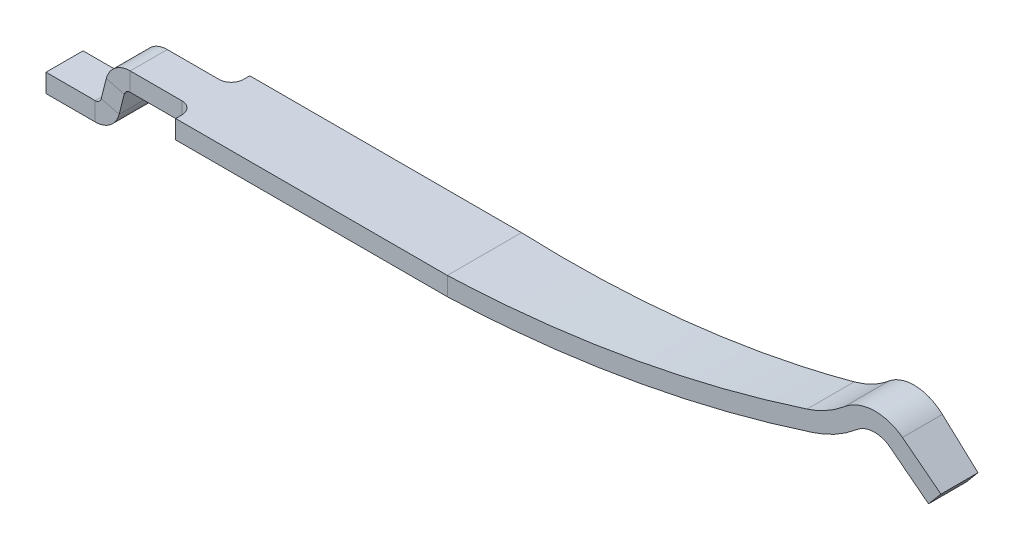
ISO-10303-21;
HEADER;
FILE_DESCRIPTION(('STEP AP214'),'2;1');
FILE_NAME('part.step','',(''),(''),'','','');
FILE_SCHEMA(('AUTOMOTIVE_DESIGN { 1 0 10303 214 1 1 1 1 }'));
ENDSEC;
DATA;
#1=APPLICATION_CONTEXT('core data for automotive mechanical design processes');
#2=APPLICATION_PROTOCOL_DEFINITION('international standard','automotive_design',2000,#1);
#3=PRODUCT_CONTEXT('',#1,'mechanical');
#4=PRODUCT('Part','Part','',(#3));
#5=PRODUCT_RELATED_PRODUCT_CATEGORY('part','',(#4));
#6=PRODUCT_DEFINITION_FORMATION('','',#4);
#7=PRODUCT_DEFINITION_CONTEXT('part definition',#1,'design');
#8=PRODUCT_DEFINITION('design','',#6,#7);
#9=PRODUCT_DEFINITION_SHAPE('','',#8);
#10=(LENGTH_UNIT() NAMED_UNIT(*) SI_UNIT(.MILLI.,.METRE.));
#11=(NAMED_UNIT(*) PLANE_ANGLE_UNIT() SI_UNIT($,.RADIAN.));
#12=(NAMED_UNIT(*) SI_UNIT($,.STERADIAN.) SOLID_ANGLE_UNIT());
#13=UNCERTAINTY_MEASURE_WITH_UNIT(LENGTH_MEASURE(1.E-05),#10,'distance_accuracy_value','');
#14=(GEOMETRIC_REPRESENTATION_CONTEXT(3) GLOBAL_UNCERTAINTY_ASSIGNED_CONTEXT((#13)) GLOBAL_UNIT_ASSIGNED_CONTEXT((#10,
#11,#12)) REPRESENTATION_CONTEXT('',''));
#15=CARTESIAN_POINT('',(0.,0.,0.));
#16=DIRECTION('',(0.,0.,1.));
#17=DIRECTION('',(1.,0.,0.));
#18=AXIS2_PLACEMENT_3D('',#15,#16,#17);
#19=CARTESIAN_POINT('',(0.,0.,0.));
#20=DIRECTION('',(1.,0.,0.));
#21=DIRECTION('',(0.,0.,-1.));
#22=AXIS2_PLACEMENT_3D('',#19,#20,#21);
#23=PLANE('',#22);
#24=DIRECTION('',(0.,0.,-1.));
#25=VECTOR('',#24,1.);
#26=CARTESIAN_POINT('',(0.,0.35,0.3));
#27=LINE('',#26,#25);
#28=CARTESIAN_POINT('',(0.,0.35,-0.25));
#29=VERTEX_POINT('',#28);
#30=CARTESIAN_POINT('',(0.,0.35,-0.3));
#31=VERTEX_POINT('',#30);
#32=EDGE_CURVE('E349',#29,#31,#27,.T.);
#33=ORIENTED_EDGE('',*,*,#32,.F.);
#34=DIRECTION('',(0.,1.,0.));
#35=VECTOR('',#34,1.);
#36=CARTESIAN_POINT('',(0.,0.,-0.25));
#37=LINE('',#36,#35);
#38=CARTESIAN_POINT('',(0.,0.5,-0.25));
#39=VERTEX_POINT('',#38);
#40=EDGE_CURVE('E378',#29,#39,#37,.T.);
#41=ORIENTED_EDGE('',*,*,#40,.T.);
#42=DIRECTION('',(0.,0.,-1.));
#43=VECTOR('',#42,1.);
#44=CARTESIAN_POINT('',(0.,0.5,0.3));
#45=LINE('',#44,#43);
#46=CARTESIAN_POINT('',(0.,0.5,-0.3));
#47=VERTEX_POINT('',#46);
#48=EDGE_CURVE('E359',#39,#47,#45,.T.);
#49=ORIENTED_EDGE('',*,*,#48,.T.);
#50=DIRECTION('',(0.,-1.,0.));
#51=VECTOR('',#50,1.);
#52=CARTESIAN_POINT('',(0.,0.5,-0.3));
#53=LINE('',#52,#51);
#54=EDGE_CURVE('E355',#47,#31,#53,.T.);
#55=ORIENTED_EDGE('',*,*,#54,.T.);
#56=EDGE_LOOP('',(#33,#41,#49,#55));
#57=FACE_BOUND('',#56,.T.);
#58=ADVANCED_FACE('F37',(#57),#23,.F.);
#59=CARTESIAN_POINT('',(1.7,0.5,0.3));
#60=DIRECTION('',(0.,0.,-1.));
#61=DIRECTION('',(0.,1.,0.));
#62=AXIS2_PLACEMENT_3D('',#59,#60,#61);
#63=PLANE('',#62);
#64=DIRECTION('',(0.,-1.,0.));
#65=VECTOR('',#64,1.);
#66=CARTESIAN_POINT('',(0.,0.5,0.3));
#67=LINE('',#66,#65);
#68=CARTESIAN_POINT('',(0.,0.5,0.3));
#69=VERTEX_POINT('',#68);
#70=CARTESIAN_POINT('',(0.,0.35,0.3));
#71=VERTEX_POINT('',#70);
#72=EDGE_CURVE('E345',#69,#71,#67,.T.);
#73=ORIENTED_EDGE('',*,*,#72,.T.);
#74=DIRECTION('',(-1.,0.,0.));
#75=VECTOR('',#74,1.);
#76=CARTESIAN_POINT('',(1.7,0.35,0.3));
#77=LINE('',#76,#75);
#78=CARTESIAN_POINT('',(2.2,0.35,0.3));
#79=VERTEX_POINT('',#78);
#80=EDGE_CURVE('E374',#79,#71,#77,.T.);
#81=ORIENTED_EDGE('',*,*,#80,.F.);
#82=DIRECTION('',(0.,-1.,0.));
#83=VECTOR('',#82,1.);
#84=CARTESIAN_POINT('',(2.2,0.5,0.3));
#85=LINE('',#84,#83);
#86=CARTESIAN_POINT('',(2.2,0.5,0.3));
#87=VERTEX_POINT('',#86);
#88=EDGE_CURVE('E591',#87,#79,#85,.T.);
#89=ORIENTED_EDGE('',*,*,#88,.F.);
#90=DIRECTION('',(-1.,0.,0.));
#91=VECTOR('',#90,1.);
#92=CARTESIAN_POINT('',(1.7,0.5,0.3));
#93=LINE('',#92,#91);
#94=EDGE_CURVE('E363',#87,#69,#93,.T.);
#95=ORIENTED_EDGE('',*,*,#94,.T.);
#96=EDGE_LOOP('',(#73,#81,#89,#95));
#97=FACE_BOUND('',#96,.T.);
#98=ADVANCED_FACE('F652',(#97),#63,.F.);
#99=CARTESIAN_POINT('',(1.7,0.35,0.3));
#100=DIRECTION('',(0.,1.,0.));
#101=DIRECTION('',(0.,0.,1.));
#102=AXIS2_PLACEMENT_3D('',#99,#100,#101);
#103=PLANE('',#102);
#104=CARTESIAN_POINT('',(0.,0.35,0.25));
#105=VERTEX_POINT('',#104);
#106=EDGE_CURVE('E351',#71,#105,#27,.T.);
#107=ORIENTED_EDGE('',*,*,#106,.T.);
#108=CARTESIAN_POINT('',(-0.1,0.35,0.25));
#109=DIRECTION('',(0.,1.,0.));
#110=DIRECTION('',(0.,0.,1.));
#111=AXIS2_PLACEMENT_3D('',#108,#109,#110);
#112=CIRCLE('',#111,0.1);
#113=CARTESIAN_POINT('',(-0.1,0.35,0.15));
#114=VERTEX_POINT('',#113);
#115=EDGE_CURVE('E482',#105,#114,#112,.T.);
#116=ORIENTED_EDGE('',*,*,#115,.T.);
#117=DIRECTION('',(1.,0.,0.));
#118=VECTOR('',#117,1.);
#119=CARTESIAN_POINT('',(-0.517954851978347,0.35,0.15));
#120=LINE('',#119,#118);
#121=CARTESIAN_POINT('',(-0.517954851978347,0.35,0.15));
#122=VERTEX_POINT('',#121);
#123=EDGE_CURVE('E386',#122,#114,#120,.T.);
#124=ORIENTED_EDGE('',*,*,#123,.F.);
#125=DIRECTION('',(0.,0.,1.));
#126=VECTOR('',#125,1.);
#127=CARTESIAN_POINT('',(-0.517954851978347,0.35,0.3));
#128=LINE('',#127,#126);
#129=CARTESIAN_POINT('',(-0.517954851978347,0.35,-0.15));
#130=VERTEX_POINT('',#129);
#131=EDGE_CURVE('E408',#122,#130,#128,.F.);
#132=ORIENTED_EDGE('',*,*,#131,.T.);
#133=DIRECTION('',(1.,0.,0.));
#134=VECTOR('',#133,1.);
#135=CARTESIAN_POINT('',(1.7,0.35,-0.15));
#136=LINE('',#135,#134);
#137=CARTESIAN_POINT('',(-0.1,0.35,-0.15));
#138=VERTEX_POINT('',#137);
#139=EDGE_CURVE('E390',#130,#138,#136,.T.);
#140=ORIENTED_EDGE('',*,*,#139,.T.);
#141=CARTESIAN_POINT('',(-0.1,0.35,-0.25));
#142=DIRECTION('',(0.,1.,0.));
#143=DIRECTION('',(0.,0.,1.));
#144=AXIS2_PLACEMENT_3D('',#141,#142,#143);
#145=CIRCLE('',#144,0.1);
#146=EDGE_CURVE('E479',#138,#29,#145,.T.);
#147=ORIENTED_EDGE('',*,*,#146,.T.);
#148=ORIENTED_EDGE('',*,*,#32,.T.);
#149=DIRECTION('',(-1.,0.,0.));
#150=VECTOR('',#149,1.);
#151=CARTESIAN_POINT('',(1.7,0.35,-0.3));
#152=LINE('',#151,#150);
#153=CARTESIAN_POINT('',(2.2,0.35,-0.3));
#154=VERTEX_POINT('',#153);
#155=EDGE_CURVE('E370',#154,#31,#152,.T.);
#156=ORIENTED_EDGE('',*,*,#155,.F.);
#157=DIRECTION('',(0.,0.,-1.));
#158=VECTOR('',#157,1.);
#159=CARTESIAN_POINT('',(2.2,0.35,0.3));
#160=LINE('',#159,#158);
#161=EDGE_CURVE('E582',#79,#154,#160,.T.);
#162=ORIENTED_EDGE('',*,*,#161,.F.);
#163=ORIENTED_EDGE('',*,*,#80,.T.);
#164=EDGE_LOOP('',(#107,#116,#124,#132,#140,#147,#148,#156,#162,#163));
#165=FACE_BOUND('',#164,.T.);
#166=ADVANCED_FACE('F500',(#165),#103,.F.);
#167=CARTESIAN_POINT('',(1.7,0.5,-0.3));
#168=DIRECTION('',(0.,0.,-1.));
#169=DIRECTION('',(-1.,0.,0.));
#170=AXIS2_PLACEMENT_3D('',#167,#168,#169);
#171=PLANE('',#170);
#172=ORIENTED_EDGE('',*,*,#54,.F.);
#173=DIRECTION('',(-1.,0.,0.));
#174=VECTOR('',#173,1.);
#175=CARTESIAN_POINT('',(1.7,0.5,-0.3));
#176=LINE('',#175,#174);
#177=CARTESIAN_POINT('',(2.2,0.5,-0.3));
#178=VERTEX_POINT('',#177);
#179=EDGE_CURVE('E366',#178,#47,#176,.T.);
#180=ORIENTED_EDGE('',*,*,#179,.F.);
#181=DIRECTION('',(0.,1.,0.));
#182=VECTOR('',#181,1.);
#183=CARTESIAN_POINT('',(2.2,0.5,-0.3));
#184=LINE('',#183,#182);
#185=EDGE_CURVE('E577',#154,#178,#184,.T.);
#186=ORIENTED_EDGE('',*,*,#185,.F.);
#187=ORIENTED_EDGE('',*,*,#155,.T.);
#188=EDGE_LOOP('',(#172,#180,#186,#187));
#189=FACE_BOUND('',#188,.T.);
#190=ADVANCED_FACE('F575',(#189),#171,.T.);
#191=CARTESIAN_POINT('',(1.7,0.5,0.3));
#192=DIRECTION('',(0.,1.,0.));
#193=DIRECTION('',(0.,0.,1.));
#194=AXIS2_PLACEMENT_3D('',#191,#192,#193);
#195=PLANE('',#194);
#196=CARTESIAN_POINT('',(0.,0.5,0.25));
#197=VERTEX_POINT('',#196);
#198=EDGE_CURVE('E362',#69,#197,#45,.T.);
#199=ORIENTED_EDGE('',*,*,#198,.F.);
#200=ORIENTED_EDGE('',*,*,#94,.F.);
#201=DIRECTION('',(0.,0.,1.));
#202=VECTOR('',#201,1.);
#203=CARTESIAN_POINT('',(2.2,0.5,0.3));
#204=LINE('',#203,#202);
#205=EDGE_CURVE('E581',#178,#87,#204,.T.);
#206=ORIENTED_EDGE('',*,*,#205,.F.);
#207=ORIENTED_EDGE('',*,*,#179,.T.);
#208=ORIENTED_EDGE('',*,*,#48,.F.);
#209=CARTESIAN_POINT('',(-0.1,0.5,-0.25));
#210=DIRECTION('',(0.,1.,0.));
#211=DIRECTION('',(0.,0.,1.));
#212=AXIS2_PLACEMENT_3D('',#209,#210,#211);
#213=CIRCLE('',#212,0.1);
#214=CARTESIAN_POINT('',(-0.1,0.5,-0.15));
#215=VERTEX_POINT('',#214);
#216=EDGE_CURVE('E476',#39,#215,#213,.F.);
#217=ORIENTED_EDGE('',*,*,#216,.T.);
#218=DIRECTION('',(-1.,0.,0.));
#219=VECTOR('',#218,1.);
#220=CARTESIAN_POINT('',(-0.517954851978347,0.5,-0.15));
#221=LINE('',#220,#219);
#222=CARTESIAN_POINT('',(-0.517954851978347,0.5,-0.15));
#223=VERTEX_POINT('',#222);
#224=EDGE_CURVE('E350',#223,#215,#221,.F.);
#225=ORIENTED_EDGE('',*,*,#224,.F.);
#226=DIRECTION('',(0.,0.,1.));
#227=VECTOR('',#226,1.);
#228=CARTESIAN_POINT('',(-0.517954851978347,0.5,0.3));
#229=LINE('',#228,#227);
#230=CARTESIAN_POINT('',(-0.517954851978347,0.5,0.15));
#231=VERTEX_POINT('',#230);
#232=EDGE_CURVE('E301',#223,#231,#229,.T.);
#233=ORIENTED_EDGE('',*,*,#232,.T.);
#234=DIRECTION('',(1.,0.,0.));
#235=VECTOR('',#234,1.);
#236=CARTESIAN_POINT('',(1.7,0.5,0.15));
#237=LINE('',#236,#235);
#238=CARTESIAN_POINT('',(-0.1,0.5,0.15));
#239=VERTEX_POINT('',#238);
#240=EDGE_CURVE('E382',#231,#239,#237,.T.);
#241=ORIENTED_EDGE('',*,*,#240,.T.);
#242=CARTESIAN_POINT('',(-0.1,0.5,0.25));
#243=DIRECTION('',(0.,1.,0.));
#244=DIRECTION('',(0.,0.,1.));
#245=AXIS2_PLACEMENT_3D('',#242,#243,#244);
#246=CIRCLE('',#245,0.1);
#247=EDGE_CURVE('E256',#239,#197,#246,.F.);
#248=ORIENTED_EDGE('',*,*,#247,.T.);
#249=EDGE_LOOP('',(#199,#200,#206,#207,#208,#217,#225,#233,#241,#248));
#250=FACE_BOUND('',#249,.T.);
#251=ADVANCED_FACE('F490',(#250),#195,.T.);
#252=ORIENTED_EDGE('',*,*,#198,.T.);
#253=DIRECTION('',(0.,-1.,0.));
#254=VECTOR('',#253,1.);
#255=CARTESIAN_POINT('',(0.,0.,0.25));
#256=LINE('',#255,#254);
#257=EDGE_CURVE('E469',#197,#105,#256,.T.);
#258=ORIENTED_EDGE('',*,*,#257,.T.);
#259=ORIENTED_EDGE('',*,*,#106,.F.);
#260=ORIENTED_EDGE('',*,*,#72,.F.);
#261=EDGE_LOOP('',(#252,#258,#259,#260));
#262=FACE_BOUND('',#261,.T.);
#263=ADVANCED_FACE('F497',(#262),#23,.F.);
#264=CARTESIAN_POINT('',(-0.517954851978347,0.5,0.15));
#265=DIRECTION('',(0.,0.,1.));
#266=DIRECTION('',(0.,-1.,0.));
#267=AXIS2_PLACEMENT_3D('',#264,#265,#266);
#268=PLANE('',#267);
#269=ORIENTED_EDGE('',*,*,#123,.T.);
#270=DIRECTION('',(0.,-1.,0.));
#271=VECTOR('',#270,1.);
#272=CARTESIAN_POINT('',(-0.1,0.5,0.15));
#273=LINE('',#272,#271);
#274=EDGE_CURVE('E473',#114,#239,#273,.F.);
#275=ORIENTED_EDGE('',*,*,#274,.T.);
#276=ORIENTED_EDGE('',*,*,#240,.F.);
#277=DIRECTION('',(0.,-1.,0.));
#278=VECTOR('',#277,1.);
#279=CARTESIAN_POINT('',(-0.517954851978347,0.5,0.15));
#280=LINE('',#279,#278);
#281=EDGE_CURVE('E404',#231,#122,#280,.T.);
#282=ORIENTED_EDGE('',*,*,#281,.T.);
#283=EDGE_LOOP('',(#269,#275,#276,#282));
#284=FACE_BOUND('',#283,.T.);
#285=ADVANCED_FACE('F502',(#284),#268,.T.);
#286=CARTESIAN_POINT('',(-0.517954851978347,0.5,-0.15));
#287=DIRECTION('',(0.,0.,-1.));
#288=DIRECTION('',(-1.,0.,0.));
#289=AXIS2_PLACEMENT_3D('',#286,#287,#288);
#290=PLANE('',#289);
#291=ORIENTED_EDGE('',*,*,#224,.T.);
#292=DIRECTION('',(0.,1.,0.));
#293=VECTOR('',#292,1.);
#294=CARTESIAN_POINT('',(-0.1,0.5,-0.15));
#295=LINE('',#294,#293);
#296=EDGE_CURVE('E466',#215,#138,#295,.F.);
#297=ORIENTED_EDGE('',*,*,#296,.T.);
#298=ORIENTED_EDGE('',*,*,#139,.F.);
#299=DIRECTION('',(0.,1.,0.));
#300=VECTOR('',#299,1.);
#301=CARTESIAN_POINT('',(-0.517954851978347,0.5,-0.15));
#302=LINE('',#301,#300);
#303=EDGE_CURVE('E412',#130,#223,#302,.T.);
#304=ORIENTED_EDGE('',*,*,#303,.T.);
#305=EDGE_LOOP('',(#291,#297,#298,#304));
#306=FACE_BOUND('',#305,.T.);
#307=ADVANCED_FACE('F557',(#306),#290,.T.);
#308=CARTESIAN_POINT('',(-0.517954851978347,0.3,0.));
#309=DIRECTION('',(0.,0.,-1.));
#310=DIRECTION('',(-1.,0.,0.));
#311=AXIS2_PLACEMENT_3D('',#308,#309,#310);
#312=CYLINDRICAL_SURFACE('',#311,0.2);
#313=DIRECTION('',(0.,0.,-1.));
#314=VECTOR('',#313,1.);
#315=CARTESIAN_POINT('',(-0.711686668360144,0.349678801529522,0.));
#316=LINE('',#315,#314);
#317=CARTESIAN_POINT('',(-0.711686668360144,0.349678801529522,-0.15));
#318=VERTEX_POINT('',#317);
#319=CARTESIAN_POINT('',(-0.711686668360144,0.349678801529522,0.15));
#320=VERTEX_POINT('',#319);
#321=EDGE_CURVE('E309',#318,#320,#316,.F.);
#322=ORIENTED_EDGE('',*,*,#321,.T.);
#323=CARTESIAN_POINT('',(-0.517954851978347,0.3,0.15));
#324=DIRECTION('',(0.,0.,-1.));
#325=DIRECTION('',(-1.,0.,0.));
#326=AXIS2_PLACEMENT_3D('',#323,#324,#325);
#327=CIRCLE('',#326,0.2);
#328=EDGE_CURVE('E296',#320,#231,#327,.T.);
#329=ORIENTED_EDGE('',*,*,#328,.T.);
#330=ORIENTED_EDGE('',*,*,#232,.F.);
#331=CARTESIAN_POINT('',(-0.517954851978347,0.3,-0.15));
#332=DIRECTION('',(0.,0.,-1.));
#333=DIRECTION('',(-1.,0.,0.));
#334=AXIS2_PLACEMENT_3D('',#331,#332,#333);
#335=CIRCLE('',#334,0.2);
#336=EDGE_CURVE('E394',#318,#223,#335,.T.);
#337=ORIENTED_EDGE('',*,*,#336,.F.);
#338=EDGE_LOOP('',(#322,#329,#330,#337));
#339=FACE_BOUND('',#338,.T.);
#340=ADVANCED_FACE('F560',(#339),#312,.T.);
#341=CARTESIAN_POINT('',(-0.711686668360144,0.349678801529522,0.15));
#342=DIRECTION('',(0.,0.,1.));
#343=DIRECTION('',(1.,0.,0.));
#344=AXIS2_PLACEMENT_3D('',#341,#342,#343);
#345=PLANE('',#344);
#346=DIRECTION('',(0.968659081908986,-0.248394007647608,0.));
#347=VECTOR('',#346,1.);
#348=CARTESIAN_POINT('',(-0.711686668360144,0.349678801529522,0.15));
#349=LINE('',#348,#347);
#350=CARTESIAN_POINT('',(-0.566387806073796,0.31241970038238,0.15));
#351=VERTEX_POINT('',#350);
#352=EDGE_CURVE('E290',#320,#351,#349,.T.);
#353=ORIENTED_EDGE('',*,*,#352,.T.);
#354=CARTESIAN_POINT('',(-0.517954851978347,0.3,0.15));
#355=DIRECTION('',(0.,0.,-1.));
#356=DIRECTION('',(-1.,0.,0.));
#357=AXIS2_PLACEMENT_3D('',#354,#355,#356);
#358=CIRCLE('',#357,0.0499999999999999);
#359=EDGE_CURVE('E292',#351,#122,#358,.T.);
#360=ORIENTED_EDGE('',*,*,#359,.T.);
#361=ORIENTED_EDGE('',*,*,#281,.F.);
#362=ORIENTED_EDGE('',*,*,#328,.F.);
#363=EDGE_LOOP('',(#353,#360,#361,#362));
#364=FACE_BOUND('',#363,.T.);
#365=ADVANCED_FACE('F509',(#364),#345,.T.);
#366=CARTESIAN_POINT('',(-0.517954851978347,0.3,0.));
#367=DIRECTION('',(0.,0.,-1.));
#368=DIRECTION('',(-1.,0.,0.));
#369=AXIS2_PLACEMENT_3D('',#366,#367,#368);
#370=CYLINDRICAL_SURFACE('',#369,0.0499999999999999);
#371=DIRECTION('',(0.,0.,-1.));
#372=VECTOR('',#371,1.);
#373=CARTESIAN_POINT('',(-0.566387806073796,0.31241970038238,-0.15));
#374=LINE('',#373,#372);
#375=CARTESIAN_POINT('',(-0.566387806073796,0.31241970038238,-0.15));
#376=VERTEX_POINT('',#375);
#377=EDGE_CURVE('E286',#351,#376,#374,.T.);
#378=ORIENTED_EDGE('',*,*,#377,.T.);
#379=CARTESIAN_POINT('',(-0.517954851978347,0.3,-0.15));
#380=DIRECTION('',(0.,0.,-1.));
#381=DIRECTION('',(-1.,0.,0.));
#382=AXIS2_PLACEMENT_3D('',#379,#380,#381);
#383=CIRCLE('',#382,0.0499999999999999);
#384=EDGE_CURVE('E297',#376,#130,#383,.T.);
#385=ORIENTED_EDGE('',*,*,#384,.T.);
#386=ORIENTED_EDGE('',*,*,#131,.F.);
#387=ORIENTED_EDGE('',*,*,#359,.F.);
#388=EDGE_LOOP('',(#378,#385,#386,#387));
#389=FACE_BOUND('',#388,.T.);
#390=ADVANCED_FACE('F507',(#389),#370,.F.);
#391=CARTESIAN_POINT('',(-0.711686668360144,0.349678801529522,-0.15));
#392=DIRECTION('',(0.,0.,-1.));
#393=DIRECTION('',(-1.,0.,0.));
#394=AXIS2_PLACEMENT_3D('',#391,#392,#393);
#395=PLANE('',#394);
#396=DIRECTION('',(-0.968659081908986,0.248394007647608,0.));
#397=VECTOR('',#396,1.);
#398=CARTESIAN_POINT('',(-0.711686668360144,0.349678801529522,-0.15));
#399=LINE('',#398,#397);
#400=EDGE_CURVE('E291',#376,#318,#399,.T.);
#401=ORIENTED_EDGE('',*,*,#400,.T.);
#402=ORIENTED_EDGE('',*,*,#336,.T.);
#403=ORIENTED_EDGE('',*,*,#303,.F.);
#404=ORIENTED_EDGE('',*,*,#384,.F.);
#405=EDGE_LOOP('',(#401,#402,#403,#404));
#406=FACE_BOUND('',#405,.T.);
#407=ADVANCED_FACE('F554',(#406),#395,.T.);
#408=CARTESIAN_POINT('',(-0.753253714264694,0.18758029961762,-0.15));
#409=DIRECTION('',(-0.968659081908986,0.248394007647608,0.));
#410=DIRECTION('',(-0.248394007647608,-0.968659081908986,0.));
#411=AXIS2_PLACEMENT_3D('',#408,#409,#410);
#412=PLANE('',#411);
#413=DIRECTION('',(0.,0.,1.));
#414=VECTOR('',#413,1.);
#415=CARTESIAN_POINT('',(-0.753253714264694,0.18758029961762,-0.15));
#416=LINE('',#415,#414);
#417=CARTESIAN_POINT('',(-0.753253714264694,0.18758029961762,-0.15));
#418=VERTEX_POINT('',#417);
#419=CARTESIAN_POINT('',(-0.753253714264694,0.18758029961762,0.15));
#420=VERTEX_POINT('',#419);
#421=EDGE_CURVE('E433',#418,#420,#416,.T.);
#422=ORIENTED_EDGE('',*,*,#421,.T.);
#423=DIRECTION('',(-0.248394007647608,-0.968659081908986,0.));
#424=VECTOR('',#423,1.);
#425=CARTESIAN_POINT('',(-0.753253714264694,0.18758029961762,0.15));
#426=LINE('',#425,#424);
#427=EDGE_CURVE('E326',#420,#320,#426,.F.);
#428=ORIENTED_EDGE('',*,*,#427,.T.);
#429=ORIENTED_EDGE('',*,*,#321,.F.);
#430=DIRECTION('',(0.248394007647608,0.968659081908986,0.));
#431=VECTOR('',#430,1.);
#432=CARTESIAN_POINT('',(-0.753253714264694,0.18758029961762,-0.15));
#433=LINE('',#432,#431);
#434=EDGE_CURVE('E416',#418,#318,#433,.T.);
#435=ORIENTED_EDGE('',*,*,#434,.F.);
#436=EDGE_LOOP('',(#422,#428,#429,#435));
#437=FACE_BOUND('',#436,.T.);
#438=ADVANCED_FACE('F549',(#437),#412,.T.);
#439=CARTESIAN_POINT('',(-0.753253714264694,0.18758029961762,0.15));
#440=DIRECTION('',(0.,0.,1.));
#441=DIRECTION('',(1.,0.,0.));
#442=AXIS2_PLACEMENT_3D('',#439,#440,#441);
#443=PLANE('',#442);
#444=DIRECTION('',(0.968659081908986,-0.248394007647608,0.));
#445=VECTOR('',#444,1.);
#446=CARTESIAN_POINT('',(-0.753253714264694,0.18758029961762,0.15));
#447=LINE('',#446,#445);
#448=CARTESIAN_POINT('',(-0.607954851978346,0.150321198470478,0.15));
#449=VERTEX_POINT('',#448);
#450=EDGE_CURVE('E437',#420,#449,#447,.T.);
#451=ORIENTED_EDGE('',*,*,#450,.T.);
#452=DIRECTION('',(0.248394007647608,0.968659081908986,0.));
#453=VECTOR('',#452,1.);
#454=CARTESIAN_POINT('',(-0.607954851978346,0.150321198470478,0.15));
#455=LINE('',#454,#453);
#456=EDGE_CURVE('E322',#449,#351,#455,.T.);
#457=ORIENTED_EDGE('',*,*,#456,.T.);
#458=ORIENTED_EDGE('',*,*,#352,.F.);
#459=ORIENTED_EDGE('',*,*,#427,.F.);
#460=EDGE_LOOP('',(#451,#457,#458,#459));
#461=FACE_BOUND('',#460,.T.);
#462=ADVANCED_FACE('F516',(#461),#443,.T.);
#463=CARTESIAN_POINT('',(-0.607954851978346,0.150321198470478,-0.15));
#464=DIRECTION('',(0.968659081908986,-0.248394007647608,0.));
#465=DIRECTION('',(0.248394007647608,0.968659081908986,0.));
#466=AXIS2_PLACEMENT_3D('',#463,#464,#465);
#467=PLANE('',#466);
#468=DIRECTION('',(0.,0.,1.));
#469=VECTOR('',#468,1.);
#470=CARTESIAN_POINT('',(-0.607954851978346,0.150321198470478,-0.15));
#471=LINE('',#470,#469);
#472=CARTESIAN_POINT('',(-0.607954851978346,0.150321198470478,-0.15));
#473=VERTEX_POINT('',#472);
#474=EDGE_CURVE('E441',#449,#473,#471,.F.);
#475=ORIENTED_EDGE('',*,*,#474,.T.);
#476=DIRECTION('',(0.248394007647608,0.968659081908986,0.));
#477=VECTOR('',#476,1.);
#478=CARTESIAN_POINT('',(-0.607954851978346,0.150321198470478,-0.15));
#479=LINE('',#478,#477);
#480=EDGE_CURVE('E327',#473,#376,#479,.T.);
#481=ORIENTED_EDGE('',*,*,#480,.T.);
#482=ORIENTED_EDGE('',*,*,#377,.F.);
#483=ORIENTED_EDGE('',*,*,#456,.F.);
#484=EDGE_LOOP('',(#475,#481,#482,#483));
#485=FACE_BOUND('',#484,.T.);
#486=ADVANCED_FACE('F514',(#485),#467,.T.);
#487=CARTESIAN_POINT('',(-0.753253714264694,0.18758029961762,-0.15));
#488=DIRECTION('',(0.,0.,-1.));
#489=DIRECTION('',(-1.,0.,0.));
#490=AXIS2_PLACEMENT_3D('',#487,#488,#489);
#491=PLANE('',#490);
#492=DIRECTION('',(-0.968659081908986,0.248394007647608,0.));
#493=VECTOR('',#492,1.);
#494=CARTESIAN_POINT('',(-0.607954851978346,0.150321198470478,-0.15));
#495=LINE('',#494,#493);
#496=EDGE_CURVE('E344',#473,#418,#495,.T.);
#497=ORIENTED_EDGE('',*,*,#496,.T.);
#498=ORIENTED_EDGE('',*,*,#434,.T.);
#499=ORIENTED_EDGE('',*,*,#400,.F.);
#500=ORIENTED_EDGE('',*,*,#480,.F.);
#501=EDGE_LOOP('',(#497,#498,#499,#500));
#502=FACE_BOUND('',#501,.T.);
#503=ADVANCED_FACE('F552',(#502),#491,.T.);
#504=CARTESIAN_POINT('',(-0.801686668360144,0.2,0.));
#505=DIRECTION('',(0.,0.,1.));
#506=DIRECTION('',(1.,0.,0.));
#507=AXIS2_PLACEMENT_3D('',#504,#505,#506);
#508=CYLINDRICAL_SURFACE('',#507,0.0500000000000001);
#509=DIRECTION('',(0.,0.,1.));
#510=VECTOR('',#509,1.);
#511=CARTESIAN_POINT('',(-0.801686668360144,0.15,-0.15));
#512=LINE('',#511,#510);
#513=CARTESIAN_POINT('',(-0.801686668360144,0.15,-0.15));
#514=VERTEX_POINT('',#513);
#515=CARTESIAN_POINT('',(-0.801686668360144,0.15,0.15));
#516=VERTEX_POINT('',#515);
#517=EDGE_CURVE('E280',#514,#516,#512,.T.);
#518=ORIENTED_EDGE('',*,*,#517,.T.);
#519=CARTESIAN_POINT('',(-0.801686668360144,0.2,0.15));
#520=DIRECTION('',(0.,0.,1.));
#521=DIRECTION('',(1.,0.,0.));
#522=AXIS2_PLACEMENT_3D('',#519,#520,#521);
#523=CIRCLE('',#522,0.0500000000000001);
#524=EDGE_CURVE('E313',#516,#420,#523,.T.);
#525=ORIENTED_EDGE('',*,*,#524,.T.);
#526=ORIENTED_EDGE('',*,*,#421,.F.);
#527=CARTESIAN_POINT('',(-0.801686668360144,0.2,-0.15));
#528=DIRECTION('',(0.,0.,1.));
#529=DIRECTION('',(1.,0.,0.));
#530=AXIS2_PLACEMENT_3D('',#527,#528,#529);
#531=CIRCLE('',#530,0.0500000000000001);
#532=EDGE_CURVE('E305',#514,#418,#531,.T.);
#533=ORIENTED_EDGE('',*,*,#532,.F.);
#534=EDGE_LOOP('',(#518,#525,#526,#533));
#535=FACE_BOUND('',#534,.T.);
#536=ADVANCED_FACE('F546',(#535),#508,.F.);
#537=CARTESIAN_POINT('',(-0.801686668360144,0.15,0.15));
#538=DIRECTION('',(0.,0.,1.));
#539=DIRECTION('',(1.,0.,0.));
#540=AXIS2_PLACEMENT_3D('',#537,#538,#539);
#541=PLANE('',#540);
#542=DIRECTION('',(0.,-1.,0.));
#543=VECTOR('',#542,1.);
#544=CARTESIAN_POINT('',(-0.801686668360144,0.15,0.15));
#545=LINE('',#544,#543);
#546=CARTESIAN_POINT('',(-0.801686668360144,0.,0.15));
#547=VERTEX_POINT('',#546);
#548=EDGE_CURVE('E284',#516,#547,#545,.T.);
#549=ORIENTED_EDGE('',*,*,#548,.T.);
#550=CARTESIAN_POINT('',(-0.801686668360144,0.2,0.15));
#551=DIRECTION('',(0.,0.,1.));
#552=DIRECTION('',(1.,0.,0.));
#553=AXIS2_PLACEMENT_3D('',#550,#551,#552);
#554=CIRCLE('',#553,0.2);
#555=EDGE_CURVE('E317',#547,#449,#554,.T.);
#556=ORIENTED_EDGE('',*,*,#555,.T.);
#557=ORIENTED_EDGE('',*,*,#450,.F.);
#558=ORIENTED_EDGE('',*,*,#524,.F.);
#559=EDGE_LOOP('',(#549,#556,#557,#558));
#560=FACE_BOUND('',#559,.T.);
#561=ADVANCED_FACE('F523',(#560),#541,.T.);
#562=CARTESIAN_POINT('',(-0.801686668360144,0.2,0.));
#563=DIRECTION('',(0.,0.,1.));
#564=DIRECTION('',(1.,0.,0.));
#565=AXIS2_PLACEMENT_3D('',#562,#563,#564);
#566=CYLINDRICAL_SURFACE('',#565,0.2);
#567=DIRECTION('',(0.,0.,1.));
#568=VECTOR('',#567,1.);
#569=CARTESIAN_POINT('',(-0.801686668360144,0.,0.));
#570=LINE('',#569,#568);
#571=CARTESIAN_POINT('',(-0.801686668360144,0.,-0.15));
#572=VERTEX_POINT('',#571);
#573=EDGE_CURVE('E321',#547,#572,#570,.F.);
#574=ORIENTED_EDGE('',*,*,#573,.T.);
#575=CARTESIAN_POINT('',(-0.801686668360144,0.2,-0.15));
#576=DIRECTION('',(0.,0.,1.));
#577=DIRECTION('',(1.,0.,0.));
#578=AXIS2_PLACEMENT_3D('',#575,#576,#577);
#579=CIRCLE('',#578,0.2);
#580=EDGE_CURVE('E429',#572,#473,#579,.T.);
#581=ORIENTED_EDGE('',*,*,#580,.T.);
#582=ORIENTED_EDGE('',*,*,#474,.F.);
#583=ORIENTED_EDGE('',*,*,#555,.F.);
#584=EDGE_LOOP('',(#574,#581,#582,#583));
#585=FACE_BOUND('',#584,.T.);
#586=ADVANCED_FACE('F521',(#585),#566,.T.);
#587=CARTESIAN_POINT('',(-0.801686668360144,0.15,-0.15));
#588=DIRECTION('',(0.,0.,-1.));
#589=DIRECTION('',(-1.,0.,0.));
#590=AXIS2_PLACEMENT_3D('',#587,#588,#589);
#591=PLANE('',#590);
#592=DIRECTION('',(0.,1.,0.));
#593=VECTOR('',#592,1.);
#594=CARTESIAN_POINT('',(-0.801686668360144,0.15,-0.15));
#595=LINE('',#594,#593);
#596=EDGE_CURVE('E285',#572,#514,#595,.T.);
#597=ORIENTED_EDGE('',*,*,#596,.T.);
#598=ORIENTED_EDGE('',*,*,#532,.T.);
#599=ORIENTED_EDGE('',*,*,#496,.F.);
#600=ORIENTED_EDGE('',*,*,#580,.F.);
#601=EDGE_LOOP('',(#597,#598,#599,#600));
#602=FACE_BOUND('',#601,.T.);
#603=ADVANCED_FACE('F541',(#602),#591,.T.);
#604=CARTESIAN_POINT('',(-0.801686668360144,0.15,-0.15));
#605=DIRECTION('',(0.,0.,1.));
#606=DIRECTION('',(1.,0.,0.));
#607=AXIS2_PLACEMENT_3D('',#604,#605,#606);
#608=PLANE('',#607);
#609=DIRECTION('',(0.,1.,0.));
#610=VECTOR('',#609,1.);
#611=CARTESIAN_POINT('',(-1.2,0.15,-0.15));
#612=LINE('',#611,#610);
#613=CARTESIAN_POINT('',(-1.2,0.,-0.15));
#614=VERTEX_POINT('',#613);
#615=CARTESIAN_POINT('',(-1.2,0.15,-0.15));
#616=VERTEX_POINT('',#615);
#617=EDGE_CURVE('E269',#614,#616,#612,.T.);
#618=ORIENTED_EDGE('',*,*,#617,.T.);
#619=DIRECTION('',(-1.,0.,0.));
#620=VECTOR('',#619,1.);
#621=CARTESIAN_POINT('',(-0.801686668360144,0.15,-0.15));
#622=LINE('',#621,#620);
#623=EDGE_CURVE('E339',#514,#616,#622,.T.);
#624=ORIENTED_EDGE('',*,*,#623,.F.);
#625=ORIENTED_EDGE('',*,*,#596,.F.);
#626=DIRECTION('',(1.,0.,0.));
#627=VECTOR('',#626,1.);
#628=CARTESIAN_POINT('',(-0.801686668360144,0.,-0.15));
#629=LINE('',#628,#627);
#630=EDGE_CURVE('E451',#572,#614,#629,.F.);
#631=ORIENTED_EDGE('',*,*,#630,.T.);
#632=EDGE_LOOP('',(#618,#624,#625,#631));
#633=FACE_BOUND('',#632,.T.);
#634=ADVANCED_FACE('F538',(#633),#608,.F.);
#635=CARTESIAN_POINT('',(-0.801686668360144,0.15,-0.15));
#636=DIRECTION('',(0.,-1.,0.));
#637=DIRECTION('',(0.,0.,-1.));
#638=AXIS2_PLACEMENT_3D('',#635,#636,#637);
#639=PLANE('',#638);
#640=DIRECTION('',(0.,0.,-1.));
#641=VECTOR('',#640,1.);
#642=CARTESIAN_POINT('',(-1.2,0.15,-0.15));
#643=LINE('',#642,#641);
#644=CARTESIAN_POINT('',(-1.2,0.15,0.15));
#645=VERTEX_POINT('',#644);
#646=EDGE_CURVE('E275',#616,#645,#643,.F.);
#647=ORIENTED_EDGE('',*,*,#646,.T.);
#648=DIRECTION('',(-1.,0.,0.));
#649=VECTOR('',#648,1.);
#650=CARTESIAN_POINT('',(-0.801686668360144,0.15,0.15));
#651=LINE('',#650,#649);
#652=EDGE_CURVE('E335',#516,#645,#651,.T.);
#653=ORIENTED_EDGE('',*,*,#652,.F.);
#654=ORIENTED_EDGE('',*,*,#517,.F.);
#655=ORIENTED_EDGE('',*,*,#623,.T.);
#656=EDGE_LOOP('',(#647,#653,#654,#655));
#657=FACE_BOUND('',#656,.T.);
#658=ADVANCED_FACE('F544',(#657),#639,.F.);
#659=CARTESIAN_POINT('',(-0.801686668360144,0.15,0.15));
#660=DIRECTION('',(0.,0.,-1.));
#661=DIRECTION('',(0.,1.,0.));
#662=AXIS2_PLACEMENT_3D('',#659,#660,#661);
#663=PLANE('',#662);
#664=DIRECTION('',(0.,1.,0.));
#665=VECTOR('',#664,1.);
#666=CARTESIAN_POINT('',(-1.2,0.15,0.15));
#667=LINE('',#666,#665);
#668=CARTESIAN_POINT('',(-1.2,0.,0.15));
#669=VERTEX_POINT('',#668);
#670=EDGE_CURVE('E459',#645,#669,#667,.F.);
#671=ORIENTED_EDGE('',*,*,#670,.T.);
#672=DIRECTION('',(1.,0.,0.));
#673=VECTOR('',#672,1.);
#674=CARTESIAN_POINT('',(-0.801686668360144,0.,0.15));
#675=LINE('',#674,#673);
#676=EDGE_CURVE('E340',#547,#669,#675,.F.);
#677=ORIENTED_EDGE('',*,*,#676,.F.);
#678=ORIENTED_EDGE('',*,*,#548,.F.);
#679=ORIENTED_EDGE('',*,*,#652,.T.);
#680=EDGE_LOOP('',(#671,#677,#678,#679));
#681=FACE_BOUND('',#680,.T.);
#682=ADVANCED_FACE('F528',(#681),#663,.F.);
#683=CARTESIAN_POINT('',(-0.801686668360144,0.,-0.15));
#684=DIRECTION('',(0.,1.,0.));
#685=DIRECTION('',(0.,0.,1.));
#686=AXIS2_PLACEMENT_3D('',#683,#684,#685);
#687=PLANE('',#686);
#688=DIRECTION('',(0.,0.,1.));
#689=VECTOR('',#688,1.);
#690=CARTESIAN_POINT('',(-1.2,0.,-0.15));
#691=LINE('',#690,#689);
#692=EDGE_CURVE('E331',#669,#614,#691,.F.);
#693=ORIENTED_EDGE('',*,*,#692,.T.);
#694=ORIENTED_EDGE('',*,*,#630,.F.);
#695=ORIENTED_EDGE('',*,*,#573,.F.);
#696=ORIENTED_EDGE('',*,*,#676,.T.);
#697=EDGE_LOOP('',(#693,#694,#695,#696));
#698=FACE_BOUND('',#697,.T.);
#699=ADVANCED_FACE('F533',(#698),#687,.F.);
#700=CARTESIAN_POINT('',(-1.2,0.,0.));
#701=DIRECTION('',(-1.,0.,0.));
#702=DIRECTION('',(0.,0.,1.));
#703=AXIS2_PLACEMENT_3D('',#700,#701,#702);
#704=PLANE('',#703);
#705=ORIENTED_EDGE('',*,*,#617,.F.);
#706=ORIENTED_EDGE('',*,*,#692,.F.);
#707=ORIENTED_EDGE('',*,*,#670,.F.);
#708=ORIENTED_EDGE('',*,*,#646,.F.);
#709=EDGE_LOOP('',(#705,#706,#707,#708));
#710=FACE_BOUND('',#709,.T.);
#711=ADVANCED_FACE('F702',(#710),#704,.T.);
#712=CARTESIAN_POINT('',(-0.1,0.,-0.25));
#713=DIRECTION('',(0.,1.,0.));
#714=DIRECTION('',(0.,0.,1.));
#715=AXIS2_PLACEMENT_3D('',#712,#713,#714);
#716=CYLINDRICAL_SURFACE('',#715,0.1);
#717=ORIENTED_EDGE('',*,*,#146,.F.);
#718=ORIENTED_EDGE('',*,*,#296,.F.);
#719=ORIENTED_EDGE('',*,*,#216,.F.);
#720=ORIENTED_EDGE('',*,*,#40,.F.);
#721=EDGE_LOOP('',(#717,#718,#719,#720));
#722=FACE_BOUND('',#721,.T.);
#723=ADVANCED_FACE('F565',(#722),#716,.F.);
#724=CARTESIAN_POINT('',(-0.1,0.,0.25));
#725=DIRECTION('',(0.,-1.,0.));
#726=DIRECTION('',(0.,0.,-1.));
#727=AXIS2_PLACEMENT_3D('',#724,#725,#726);
#728=CYLINDRICAL_SURFACE('',#727,0.1);
#729=ORIENTED_EDGE('',*,*,#247,.F.);
#730=ORIENTED_EDGE('',*,*,#274,.F.);
#731=ORIENTED_EDGE('',*,*,#115,.F.);
#732=ORIENTED_EDGE('',*,*,#257,.F.);
#733=EDGE_LOOP('',(#729,#730,#731,#732));
#734=FACE_BOUND('',#733,.T.);
#735=ADVANCED_FACE('F39',(#734),#728,.F.);
#736=CARTESIAN_POINT('',(5.65,0.95291183461909,0.3));
#737=DIRECTION('',(-0.6445535438081,-0.764559173095464,0.));
#738=DIRECTION('',(0.764559173095464,-0.6445535438081,0.));
#739=AXIS2_PLACEMENT_3D('',#736,#737,#738);
#740=PLANE('',#739);
#741=DIRECTION('',(0.764219607542158,-0.644267276651234,-0.0298004645016205));
#742=VECTOR('',#741,1.);
#743=CARTESIAN_POINT('',(5.64693616648843,0.955494767133683,0.165587983015571));
#744=LINE('',#743,#742);
#745=CARTESIAN_POINT('',(5.65,0.95291183461909,0.165468509946705));
#746=VERTEX_POINT('',#745);
#747=CARTESIAN_POINT('',(5.95,0.699999999999997,0.153770119507289));
#748=VERTEX_POINT('',#747);
#749=EDGE_CURVE('E63',#746,#748,#744,.T.);
#750=ORIENTED_EDGE('',*,*,#749,.F.);
#751=DIRECTION('',(0.,0.,-1.));
#752=VECTOR('',#751,1.);
#753=CARTESIAN_POINT('',(5.65,0.95291183461909,0.3));
#754=LINE('',#753,#752);
#755=CARTESIAN_POINT('',(5.65,0.95291183461909,-0.165468509946705));
#756=VERTEX_POINT('',#755);
#757=EDGE_CURVE('E263',#746,#756,#754,.T.);
#758=ORIENTED_EDGE('',*,*,#757,.T.);
#759=DIRECTION('',(-0.764219607542158,0.644267276651234,-0.0298004645016205));
#760=VECTOR('',#759,1.);
#761=CARTESIAN_POINT('',(5.66060062606003,0.943975088669243,-0.165055142404864));
#762=LINE('',#761,#760);
#763=CARTESIAN_POINT('',(5.95,0.699999999999997,-0.153770119507289));
#764=VERTEX_POINT('',#763);
#765=EDGE_CURVE('E249',#764,#756,#762,.T.);
#766=ORIENTED_EDGE('',*,*,#765,.F.);
#767=DIRECTION('',(0.,0.,-1.));
#768=VECTOR('',#767,1.);
#769=CARTESIAN_POINT('',(5.95,0.699999999999997,0.3));
#770=LINE('',#769,#768);
#771=EDGE_CURVE('E261',#748,#764,#770,.T.);
#772=ORIENTED_EDGE('',*,*,#771,.F.);
#773=EDGE_LOOP('',(#750,#758,#766,#772));
#774=FACE_BOUND('',#773,.T.);
#775=ADVANCED_FACE('F260',(#774),#740,.T.);
#776=CARTESIAN_POINT('',(5.74668303157121,1.06759571058341,0.3));
#777=DIRECTION('',(0.6445535438081,0.764559173095464,0.));
#778=DIRECTION('',(-0.764559173095464,0.6445535438081,0.));
#779=AXIS2_PLACEMENT_3D('',#776,#777,#778);
#780=PLANE('',#779);
#781=DIRECTION('',(-0.764219607542158,0.644267276651234,0.0298004645016205));
#782=VECTOR('',#781,1.);
#783=CARTESIAN_POINT('',(5.74353333698367,1.07025102737216,0.161821211629584));
#784=LINE('',#783,#782);
#785=CARTESIAN_POINT('',(6.04668303157121,0.814683875964317,0.15));
#786=VERTEX_POINT('',#785);
#787=CARTESIAN_POINT('',(5.74668303157121,1.06759571058341,0.161698390439417));
#788=VERTEX_POINT('',#787);
#789=EDGE_CURVE('E614',#786,#788,#784,.T.);
#790=ORIENTED_EDGE('',*,*,#789,.F.);
#791=DIRECTION('',(0.,0.,1.));
#792=VECTOR('',#791,1.);
#793=CARTESIAN_POINT('',(6.04668303157121,0.814683875964317,0.3));
#794=LINE('',#793,#792);
#795=CARTESIAN_POINT('',(6.04668303157121,0.814683875964317,-0.15));
#796=VERTEX_POINT('',#795);
#797=EDGE_CURVE('E270',#796,#786,#794,.T.);
#798=ORIENTED_EDGE('',*,*,#797,.F.);
#799=DIRECTION('',(0.764219607542158,-0.644267276651234,0.0298004645016205));
#800=VECTOR('',#799,1.);
#801=CARTESIAN_POINT('',(5.75719779655527,1.05873134890772,-0.161288371018876));
#802=LINE('',#801,#800);
#803=CARTESIAN_POINT('',(5.74668303157121,1.06759571058341,-0.161698390439417));
#804=VERTEX_POINT('',#803);
#805=EDGE_CURVE('E53',#804,#796,#802,.T.);
#806=ORIENTED_EDGE('',*,*,#805,.F.);
#807=DIRECTION('',(0.,0.,1.));
#808=VECTOR('',#807,1.);
#809=CARTESIAN_POINT('',(5.74668303157121,1.06759571058341,0.3));
#810=LINE('',#809,#808);
#811=EDGE_CURVE('E608',#804,#788,#810,.T.);
#812=ORIENTED_EDGE('',*,*,#811,.T.);
#813=EDGE_LOOP('',(#790,#798,#806,#812));
#814=FACE_BOUND('',#813,.T.);
#815=ADVANCED_FACE('F613',(#814),#780,.T.);
#816=CARTESIAN_POINT('',(5.52108929123838,0.8,0.));
#817=DIRECTION('',(0.,0.,-1.));
#818=DIRECTION('',(-1.,0.,0.));
#819=AXIS2_PLACEMENT_3D('',#816,#817,#818);
#820=CYLINDRICAL_SURFACE('',#819,0.199999999999996);
#821=CARTESIAN_POINT('',(5.52108929123838,0.8,0.170495335956423));
#822=DIRECTION('',(-0.0389650213051027,0.,-0.999240575194329));
#823=DIRECTION('',(0.999240575194329,0.,-0.0389650213051027));
#824=AXIS2_PLACEMENT_3D('',#821,#822,#823);
#825=ELLIPSE('',#824,0.200152000394,0.199999999999996);
#826=CARTESIAN_POINT('',(5.39217858247676,0.95291183461909,0.175522161966141));
#827=VERTEX_POINT('',#826);
#828=EDGE_CURVE('E623',#827,#746,#825,.T.);
#829=ORIENTED_EDGE('',*,*,#828,.F.);
#830=DIRECTION('',(0.,0.,-1.));
#831=VECTOR('',#830,1.);
#832=CARTESIAN_POINT('',(5.39217858247676,0.95291183461909,0.3));
#833=LINE('',#832,#831);
#834=CARTESIAN_POINT('',(5.39217858247676,0.95291183461909,-0.175522161966141));
#835=VERTEX_POINT('',#834);
#836=EDGE_CURVE('E605',#827,#835,#833,.T.);
#837=ORIENTED_EDGE('',*,*,#836,.T.);
#838=CARTESIAN_POINT('',(5.52108929123838,0.8,-0.170495335956423));
#839=DIRECTION('',(-0.0389650213051028,0.,0.999240575194329));
#840=DIRECTION('',(-0.999240575194329,0.,-0.0389650213051028));
#841=AXIS2_PLACEMENT_3D('',#838,#839,#840);
#842=ELLIPSE('',#841,0.200152000394,0.199999999999996);
#843=EDGE_CURVE('E265',#756,#835,#842,.T.);
#844=ORIENTED_EDGE('',*,*,#843,.F.);
#845=ORIENTED_EDGE('',*,*,#757,.F.);
#846=EDGE_LOOP('',(#829,#837,#844,#845));
#847=FACE_BOUND('',#846,.T.);
#848=ADVANCED_FACE('F916',(#847),#820,.F.);
#849=CARTESIAN_POINT('',(5.52108929123838,0.8,0.));
#850=DIRECTION('',(0.,0.,-1.));
#851=DIRECTION('',(-1.,0.,0.));
#852=AXIS2_PLACEMENT_3D('',#849,#850,#851);
#853=CYLINDRICAL_SURFACE('',#852,0.349999999999997);
#854=DIRECTION('',(0.,0.,1.));
#855=VECTOR('',#854,1.);
#856=CARTESIAN_POINT('',(5.29549555090555,1.06759571058341,0.3));
#857=LINE('',#856,#855);
#858=CARTESIAN_POINT('',(5.29549555090555,1.06759571058341,-0.17929228147343));
#859=VERTEX_POINT('',#858);
#860=CARTESIAN_POINT('',(5.29549555090555,1.06759571058341,0.17929228147343));
#861=VERTEX_POINT('',#860);
#862=EDGE_CURVE('E602',#859,#861,#857,.T.);
#863=ORIENTED_EDGE('',*,*,#862,.T.);
#864=CARTESIAN_POINT('',(5.52108929123838,0.8,0.170495335956423));
#865=DIRECTION('',(-0.0389650213051027,0.,-0.999240575194329));
#866=DIRECTION('',(0.999240575194329,0.,-0.0389650213051027));
#867=AXIS2_PLACEMENT_3D('',#864,#865,#866);
#868=ELLIPSE('',#867,0.350266000689504,0.349999999999997);
#869=EDGE_CURVE('E621',#788,#861,#868,.F.);
#870=ORIENTED_EDGE('',*,*,#869,.F.);
#871=ORIENTED_EDGE('',*,*,#811,.F.);
#872=CARTESIAN_POINT('',(5.52108929123838,0.8,-0.170495335956423));
#873=DIRECTION('',(-0.0389650213051028,0.,0.999240575194329));
#874=DIRECTION('',(-0.999240575194329,0.,-0.0389650213051028));
#875=AXIS2_PLACEMENT_3D('',#872,#873,#874);
#876=ELLIPSE('',#875,0.350266000689504,0.349999999999997);
#877=EDGE_CURVE('E619',#859,#804,#876,.F.);
#878=ORIENTED_EDGE('',*,*,#877,.F.);
#879=EDGE_LOOP('',(#863,#870,#871,#878));
#880=FACE_BOUND('',#879,.T.);
#881=ADVANCED_FACE('F618',(#880),#853,.T.);
#882=CARTESIAN_POINT('',(4.77018809974276,1.69070706314698,0.));
#883=DIRECTION('',(0.,0.,1.));
#884=DIRECTION('',(1.,0.,0.));
#885=AXIS2_PLACEMENT_3D('',#882,#883,#884);
#886=CYLINDRICAL_SURFACE('',#885,0.96499427969817);
#887=CARTESIAN_POINT('',(4.77018809974276,1.69070706314698,0.19977645368822));
#888=DIRECTION('',(-0.0389650213051027,0.,-0.999240575194329));
#889=DIRECTION('',(-0.999240575194329,0.,0.0389650213051027));
#890=AXIS2_PLACEMENT_3D('',#887,#888,#889);
#891=ELLIPSE('',#890,0.965727677251798,0.96499427969817);
#892=CARTESIAN_POINT('',(5.04641321867504,0.766091660116593,0.189005156053407));
#893=VERTEX_POINT('',#892);
#894=EDGE_CURVE('E632',#893,#827,#891,.F.);
#895=ORIENTED_EDGE('',*,*,#894,.F.);
#896=DIRECTION('',(0.,0.,-1.));
#897=VECTOR('',#896,1.);
#898=CARTESIAN_POINT('',(5.04641321867504,0.766091660116593,0.3));
#899=LINE('',#898,#897);
#900=CARTESIAN_POINT('',(5.04641321867504,0.766091660116593,-0.189005156053407));
#901=VERTEX_POINT('',#900);
#902=EDGE_CURVE('E598',#893,#901,#899,.T.);
#903=ORIENTED_EDGE('',*,*,#902,.T.);
#904=CARTESIAN_POINT('',(4.77018809974276,1.69070706314698,-0.19977645368822));
#905=DIRECTION('',(-0.0389650213051028,0.,0.999240575194329));
#906=DIRECTION('',(0.999240575194329,0.,0.0389650213051028));
#907=AXIS2_PLACEMENT_3D('',#904,#905,#906);
#908=ELLIPSE('',#907,0.965727677251798,0.96499427969817);
#909=EDGE_CURVE('E665',#835,#901,#908,.F.);
#910=ORIENTED_EDGE('',*,*,#909,.F.);
#911=ORIENTED_EDGE('',*,*,#836,.F.);
#912=EDGE_LOOP('',(#895,#903,#910,#911));
#913=FACE_BOUND('',#912,.T.);
#914=ADVANCED_FACE('F673',(#913),#886,.T.);
#915=CARTESIAN_POINT('',(4.77018809974276,1.69070706314698,0.));
#916=DIRECTION('',(0.,0.,1.));
#917=DIRECTION('',(1.,0.,0.));
#918=AXIS2_PLACEMENT_3D('',#915,#916,#917);
#919=CYLINDRICAL_SURFACE('',#918,0.81499427969817);
#920=CARTESIAN_POINT('',(4.77018809974276,1.69070706314698,0.19977645368822));
#921=DIRECTION('',(-0.0389650213051027,0.,-0.999240575194329));
#922=DIRECTION('',(-0.999240575194329,0.,0.0389650213051027));
#923=AXIS2_PLACEMENT_3D('',#920,#921,#922);
#924=ELLIPSE('',#923,0.815613676956295,0.81499427969817);
#925=CARTESIAN_POINT('',(5.0034764171711,0.909815113584046,0.19067946094745));
#926=VERTEX_POINT('',#925);
#927=EDGE_CURVE('E625',#861,#926,#924,.T.);
#928=ORIENTED_EDGE('',*,*,#927,.F.);
#929=ORIENTED_EDGE('',*,*,#862,.F.);
#930=CARTESIAN_POINT('',(4.77018809974276,1.69070706314698,-0.19977645368822));
#931=DIRECTION('',(-0.0389650213051028,0.,0.999240575194329));
#932=DIRECTION('',(0.999240575194329,0.,0.0389650213051028));
#933=AXIS2_PLACEMENT_3D('',#930,#931,#932);
#934=ELLIPSE('',#933,0.815613676956295,0.81499427969817);
#935=CARTESIAN_POINT('',(5.0034764171711,0.909815113584046,-0.19067946094745));
#936=VERTEX_POINT('',#935);
#937=EDGE_CURVE('E658',#936,#859,#934,.T.);
#938=ORIENTED_EDGE('',*,*,#937,.F.);
#939=DIRECTION('',(0.,0.,1.));
#940=VECTOR('',#939,1.);
#941=CARTESIAN_POINT('',(5.0034764171711,0.909815113584046,0.3));
#942=LINE('',#941,#940);
#943=EDGE_CURVE('E588',#936,#926,#942,.T.);
#944=ORIENTED_EDGE('',*,*,#943,.T.);
#945=EDGE_LOOP('',(#928,#929,#938,#944));
#946=FACE_BOUND('',#945,.T.);
#947=ADVANCED_FACE('F671',(#946),#919,.F.);
#948=CARTESIAN_POINT('',(2.2,10.293963403097,0.));
#949=DIRECTION('',(0.,0.,1.));
#950=DIRECTION('',(1.,0.,0.));
#951=AXIS2_PLACEMENT_3D('',#948,#949,#950);
#952=CYLINDRICAL_SURFACE('',#951,9.94396340309702);
#953=CARTESIAN_POINT('',(2.2,10.293963403097,0.3));
#954=DIRECTION('',(-0.0389650213051027,0.,-0.999240575194329));
#955=DIRECTION('',(-0.999240575194329,0.,0.0389650213051027));
#956=AXIS2_PLACEMENT_3D('',#953,#954,#955);
#957=ELLIPSE('',#956,9.95152083487318,9.94396340309702);
#958=EDGE_CURVE('E638',#79,#893,#957,.F.);
#959=ORIENTED_EDGE('',*,*,#958,.F.);
#960=ORIENTED_EDGE('',*,*,#161,.T.);
#961=CARTESIAN_POINT('',(2.2,10.293963403097,-0.3));
#962=DIRECTION('',(-0.0389650213051028,0.,0.999240575194329));
#963=DIRECTION('',(0.999240575194329,0.,0.0389650213051028));
#964=AXIS2_PLACEMENT_3D('',#961,#962,#963);
#965=ELLIPSE('',#964,9.95152083487318,9.94396340309702);
#966=EDGE_CURVE('E661',#901,#154,#965,.F.);
#967=ORIENTED_EDGE('',*,*,#966,.F.);
#968=ORIENTED_EDGE('',*,*,#902,.F.);
#969=EDGE_LOOP('',(#959,#960,#967,#968));
#970=FACE_BOUND('',#969,.T.);
#971=ADVANCED_FACE('F650',(#970),#952,.T.);
#972=CARTESIAN_POINT('',(2.2,10.293963403097,0.));
#973=DIRECTION('',(0.,0.,1.));
#974=DIRECTION('',(1.,0.,0.));
#975=AXIS2_PLACEMENT_3D('',#972,#973,#974);
#976=CYLINDRICAL_SURFACE('',#975,9.79396340309702);
#977=CARTESIAN_POINT('',(2.2,10.293963403097,0.3));
#978=DIRECTION('',(-0.0389650213051027,0.,-0.999240575194329));
#979=DIRECTION('',(-0.999240575194329,0.,0.0389650213051027));
#980=AXIS2_PLACEMENT_3D('',#977,#978,#979);
#981=ELLIPSE('',#980,9.80140683457767,9.79396340309702);
#982=EDGE_CURVE('E635',#926,#87,#981,.T.);
#983=ORIENTED_EDGE('',*,*,#982,.F.);
#984=ORIENTED_EDGE('',*,*,#943,.F.);
#985=CARTESIAN_POINT('',(2.2,10.293963403097,-0.3));
#986=DIRECTION('',(-0.0389650213051028,0.,0.999240575194329));
#987=DIRECTION('',(0.999240575194329,0.,0.0389650213051028));
#988=AXIS2_PLACEMENT_3D('',#985,#986,#987);
#989=ELLIPSE('',#988,9.80140683457767,9.79396340309702);
#990=EDGE_CURVE('E656',#178,#936,#989,.T.);
#991=ORIENTED_EDGE('',*,*,#990,.F.);
#992=ORIENTED_EDGE('',*,*,#205,.T.);
#993=EDGE_LOOP('',(#983,#984,#991,#992));
#994=FACE_BOUND('',#993,.T.);
#995=ADVANCED_FACE('F654',(#994),#976,.F.);
#996=CARTESIAN_POINT('',(5.72440625966716,0.432404289416586,0.));
#997=DIRECTION('',(0.764559173095461,-0.644553543808104,0.));
#998=DIRECTION('',(0.,0.,-1.));
#999=AXIS2_PLACEMENT_3D('',#996,#997,#998);
#1000=PLANE('',#999);
#1001=DIRECTION('',(0.644350050086572,0.764317792076058,-0.0251261948852353));
#1002=VECTOR('',#1001,1.);
#1003=CARTESIAN_POINT('',(5.72703823100584,0.435526292002159,0.162464432263144));
#1004=LINE('',#1003,#1002);
#1005=EDGE_CURVE('E12',#748,#786,#1004,.T.);
#1006=ORIENTED_EDGE('',*,*,#1005,.F.);
#1007=ORIENTED_EDGE('',*,*,#771,.T.);
#1008=DIRECTION('',(-0.644350050086572,-0.764317792076058,-0.0251261948852353));
#1009=VECTOR('',#1008,1.);
#1010=CARTESIAN_POINT('',(5.72703823100584,0.435526292002159,-0.162464432263144));
#1011=LINE('',#1010,#1009);
#1012=EDGE_CURVE('E46',#796,#764,#1011,.T.);
#1013=ORIENTED_EDGE('',*,*,#1012,.F.);
#1014=ORIENTED_EDGE('',*,*,#797,.T.);
#1015=EDGE_LOOP('',(#1006,#1007,#1013,#1014));
#1016=FACE_BOUND('',#1015,.T.);
#1017=ADVANCED_FACE('F267',(#1016),#1000,.T.);
#1018=CARTESIAN_POINT('',(-1.2,1.15,-0.432581758313392));
#1019=DIRECTION('',(-0.0389650213051028,0.,0.999240575194329));
#1020=DIRECTION('',(0.999240575194329,0.,0.0389650213051028));
#1021=AXIS2_PLACEMENT_3D('',#1018,#1019,#1020);
#1022=PLANE('',#1021);
#1023=ORIENTED_EDGE('',*,*,#990,.T.);
#1024=ORIENTED_EDGE('',*,*,#937,.T.);
#1025=ORIENTED_EDGE('',*,*,#877,.T.);
#1026=ORIENTED_EDGE('',*,*,#805,.T.);
#1027=ORIENTED_EDGE('',*,*,#1012,.T.);
#1028=ORIENTED_EDGE('',*,*,#765,.T.);
#1029=ORIENTED_EDGE('',*,*,#843,.T.);
#1030=ORIENTED_EDGE('',*,*,#909,.T.);
#1031=ORIENTED_EDGE('',*,*,#966,.T.);
#1032=ORIENTED_EDGE('',*,*,#185,.T.);
#1033=EDGE_LOOP('',(#1023,#1024,#1025,#1026,#1027,#1028,#1029,#1030,#1031,#1032));
#1034=FACE_BOUND('',#1033,.T.);
#1035=ADVANCED_FACE('F248',(#1034),#1022,.F.);
#1036=CARTESIAN_POINT('',(6.04668303157121,1.15,0.15));
#1037=DIRECTION('',(-0.0389650213051027,0.,-0.999240575194329));
#1038=DIRECTION('',(-0.999240575194329,0.,0.0389650213051027));
#1039=AXIS2_PLACEMENT_3D('',#1036,#1037,#1038);
#1040=PLANE('',#1039);
#1041=ORIENTED_EDGE('',*,*,#958,.T.);
#1042=ORIENTED_EDGE('',*,*,#894,.T.);
#1043=ORIENTED_EDGE('',*,*,#828,.T.);
#1044=ORIENTED_EDGE('',*,*,#749,.T.);
#1045=ORIENTED_EDGE('',*,*,#1005,.T.);
#1046=ORIENTED_EDGE('',*,*,#789,.T.);
#1047=ORIENTED_EDGE('',*,*,#869,.T.);
#1048=ORIENTED_EDGE('',*,*,#927,.T.);
#1049=ORIENTED_EDGE('',*,*,#982,.T.);
#1050=ORIENTED_EDGE('',*,*,#88,.T.);
#1051=EDGE_LOOP('',(#1041,#1042,#1043,#1044,#1045,#1046,#1047,#1048,#1049,#1050));
#1052=FACE_BOUND('',#1051,.T.);
#1053=ADVANCED_FACE('F643',(#1052),#1040,.F.);
#1054=CLOSED_SHELL('',(#58,#98,#166,#190,#251,#263,#285,#307,#340,#365,#390,#407,#438,#462,#486,
#503,#536,#561,#586,#603,#634,#658,#682,#699,#711,#723,#735,#775,#815,#848,#881,#914,#947,#971,
#995,#1017,#1035,#1053));
#1055=MANIFOLD_SOLID_BREP('B2',#1054);
#1056=ADVANCED_BREP_SHAPE_REPRESENTATION('',(#18,#1055),#14);
#1057=SHAPE_DEFINITION_REPRESENTATION(#9,#1056);
ENDSEC;
END-ISO-10303-21;
